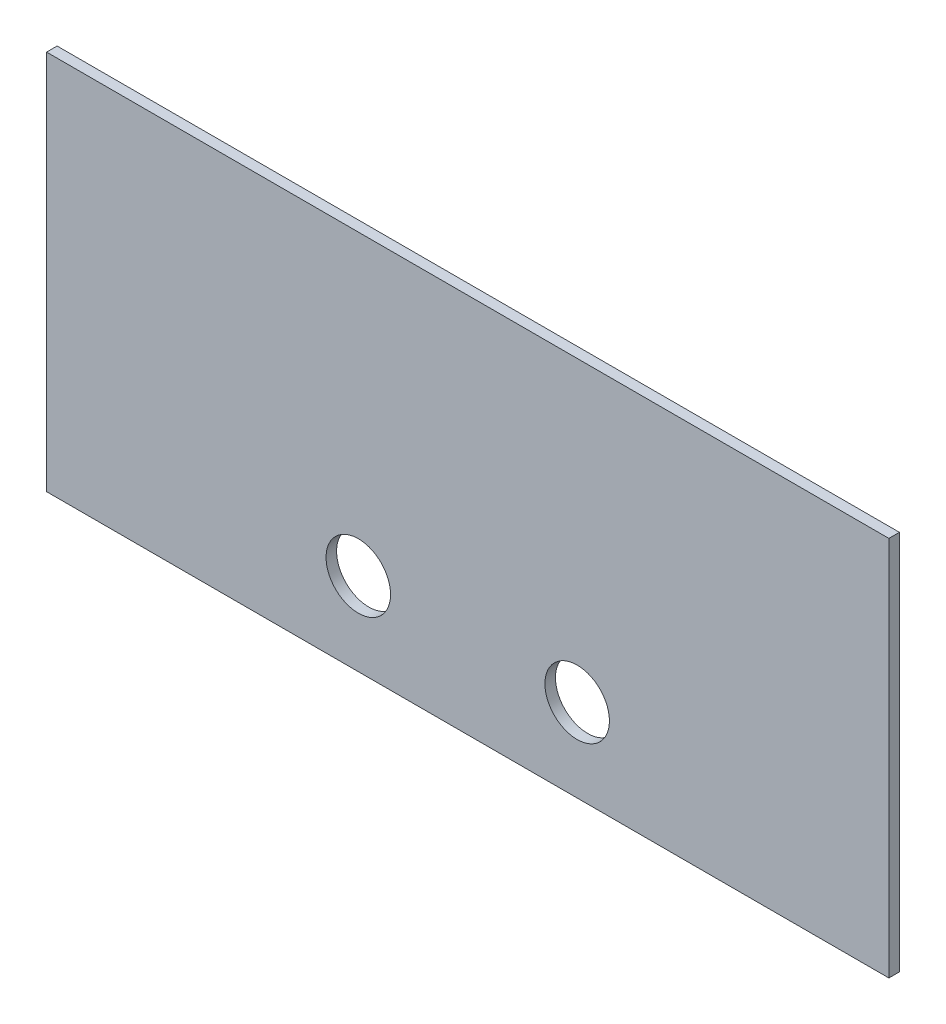
ISO-10303-21;
HEADER;
FILE_DESCRIPTION(('STEP AP214'),'2;1');
FILE_NAME('part.step','',(''),(''),'','','');
FILE_SCHEMA(('AUTOMOTIVE_DESIGN { 1 0 10303 214 1 1 1 1 }'));
ENDSEC;
DATA;
#1=APPLICATION_CONTEXT('core data for automotive mechanical design processes');
#2=APPLICATION_PROTOCOL_DEFINITION('international standard','automotive_design',2000,#1);
#3=PRODUCT_CONTEXT('',#1,'mechanical');
#4=PRODUCT('Part','Part','',(#3));
#5=PRODUCT_RELATED_PRODUCT_CATEGORY('part','',(#4));
#6=PRODUCT_DEFINITION_FORMATION('','',#4);
#7=PRODUCT_DEFINITION_CONTEXT('part definition',#1,'design');
#8=PRODUCT_DEFINITION('design','',#6,#7);
#9=PRODUCT_DEFINITION_SHAPE('','',#8);
#10=(LENGTH_UNIT() NAMED_UNIT(*) SI_UNIT(.MILLI.,.METRE.));
#11=(NAMED_UNIT(*) PLANE_ANGLE_UNIT() SI_UNIT($,.RADIAN.));
#12=(NAMED_UNIT(*) SI_UNIT($,.STERADIAN.) SOLID_ANGLE_UNIT());
#13=UNCERTAINTY_MEASURE_WITH_UNIT(LENGTH_MEASURE(1.E-05),#10,'distance_accuracy_value','');
#14=(GEOMETRIC_REPRESENTATION_CONTEXT(3) GLOBAL_UNCERTAINTY_ASSIGNED_CONTEXT((#13)) GLOBAL_UNIT_ASSIGNED_CONTEXT((#10,
#11,#12)) REPRESENTATION_CONTEXT('',''));
#15=CARTESIAN_POINT('',(0.,0.,0.));
#16=DIRECTION('',(0.,0.,1.));
#17=DIRECTION('',(1.,0.,0.));
#18=AXIS2_PLACEMENT_3D('',#15,#16,#17);
#19=CARTESIAN_POINT('',(0.,0.,1.5875));
#20=DIRECTION('',(0.,0.,-1.));
#21=DIRECTION('',(-1.,0.,0.));
#22=AXIS2_PLACEMENT_3D('',#19,#20,#21);
#23=PLANE('',#22);
#24=DIRECTION('',(0.,-1.,0.));
#25=VECTOR('',#24,1.);
#26=CARTESIAN_POINT('',(0.,0.,1.5875));
#27=LINE('',#26,#25);
#28=CARTESIAN_POINT('',(0.,57.404,1.5875));
#29=VERTEX_POINT('',#28);
#30=CARTESIAN_POINT('',(0.,0.,1.5875));
#31=VERTEX_POINT('',#30);
#32=EDGE_CURVE('E86',#29,#31,#27,.T.);
#33=ORIENTED_EDGE('',*,*,#32,.T.);
#34=DIRECTION('',(1.,0.,0.));
#35=VECTOR('',#34,1.);
#36=CARTESIAN_POINT('',(0.,0.,1.5875));
#37=LINE('',#36,#35);
#38=CARTESIAN_POINT('',(127.,0.,1.5875));
#39=VERTEX_POINT('',#38);
#40=EDGE_CURVE('E81',#31,#39,#37,.T.);
#41=ORIENTED_EDGE('',*,*,#40,.T.);
#42=DIRECTION('',(0.,1.,0.));
#43=VECTOR('',#42,1.);
#44=CARTESIAN_POINT('',(127.,0.,1.5875));
#45=LINE('',#44,#43);
#46=CARTESIAN_POINT('',(127.,57.404,1.5875));
#47=VERTEX_POINT('',#46);
#48=EDGE_CURVE('E84',#39,#47,#45,.T.);
#49=ORIENTED_EDGE('',*,*,#48,.T.);
#50=DIRECTION('',(-1.,0.,0.));
#51=VECTOR('',#50,1.);
#52=CARTESIAN_POINT('',(0.,57.404,1.5875));
#53=LINE('',#52,#51);
#54=EDGE_CURVE('E51',#47,#29,#53,.T.);
#55=ORIENTED_EDGE('',*,*,#54,.T.);
#56=EDGE_LOOP('',(#33,#41,#49,#55));
#57=FACE_BOUND('',#56,.T.);
#58=CARTESIAN_POINT('',(80.0000000000001,12.500102,1.5875));
#59=DIRECTION('',(0.,0.,1.));
#60=DIRECTION('',(1.,0.,0.));
#61=AXIS2_PLACEMENT_3D('',#58,#59,#60);
#62=CIRCLE('',#61,4.86400000000001);
#63=CARTESIAN_POINT('',(84.8640000000001,12.500102,1.5875));
#64=VERTEX_POINT('',#63);
#65=EDGE_CURVE('E101',#64,#64,#62,.T.);
#66=ORIENTED_EDGE('',*,*,#65,.F.);
#67=EDGE_LOOP('',(#66));
#68=FACE_BOUND('',#67,.T.);
#69=CARTESIAN_POINT('',(47.0000000000001,12.500102,1.5875));
#70=DIRECTION('',(0.,0.,1.));
#71=DIRECTION('',(1.,0.,0.));
#72=AXIS2_PLACEMENT_3D('',#69,#70,#71);
#73=CIRCLE('',#72,4.864);
#74=CARTESIAN_POINT('',(51.864,12.500102,1.5875));
#75=VERTEX_POINT('',#74);
#76=EDGE_CURVE('E116',#75,#75,#73,.T.);
#77=ORIENTED_EDGE('',*,*,#76,.F.);
#78=EDGE_LOOP('',(#77));
#79=FACE_BOUND('',#78,.T.);
#80=ADVANCED_FACE('F34',(#57,#68,#79),#23,.F.);
#81=CARTESIAN_POINT('',(0.,0.,0.));
#82=DIRECTION('',(0.,0.,-1.));
#83=DIRECTION('',(-1.,0.,0.));
#84=AXIS2_PLACEMENT_3D('',#81,#82,#83);
#85=PLANE('',#84);
#86=CARTESIAN_POINT('',(80.0000000000001,12.500102,0.));
#87=DIRECTION('',(0.,0.,1.));
#88=DIRECTION('',(1.,0.,0.));
#89=AXIS2_PLACEMENT_3D('',#86,#87,#88);
#90=CIRCLE('',#89,4.86400000000001);
#91=CARTESIAN_POINT('',(84.8640000000001,12.500102,0.));
#92=VERTEX_POINT('',#91);
#93=EDGE_CURVE('E113',#92,#92,#90,.T.);
#94=ORIENTED_EDGE('',*,*,#93,.T.);
#95=EDGE_LOOP('',(#94));
#96=FACE_BOUND('',#95,.T.);
#97=DIRECTION('',(0.,-1.,0.));
#98=VECTOR('',#97,1.);
#99=CARTESIAN_POINT('',(0.,0.,0.));
#100=LINE('',#99,#98);
#101=CARTESIAN_POINT('',(0.,57.404,0.));
#102=VERTEX_POINT('',#101);
#103=CARTESIAN_POINT('',(0.,0.,0.));
#104=VERTEX_POINT('',#103);
#105=EDGE_CURVE('E98',#102,#104,#100,.T.);
#106=ORIENTED_EDGE('',*,*,#105,.F.);
#107=DIRECTION('',(-1.,0.,0.));
#108=VECTOR('',#107,1.);
#109=CARTESIAN_POINT('',(0.,57.404,0.));
#110=LINE('',#109,#108);
#111=CARTESIAN_POINT('',(127.,57.404,0.));
#112=VERTEX_POINT('',#111);
#113=EDGE_CURVE('E74',#112,#102,#110,.T.);
#114=ORIENTED_EDGE('',*,*,#113,.F.);
#115=DIRECTION('',(0.,1.,0.));
#116=VECTOR('',#115,1.);
#117=CARTESIAN_POINT('',(127.,0.,0.));
#118=LINE('',#117,#116);
#119=CARTESIAN_POINT('',(127.,0.,0.));
#120=VERTEX_POINT('',#119);
#121=EDGE_CURVE('E68',#120,#112,#118,.T.);
#122=ORIENTED_EDGE('',*,*,#121,.F.);
#123=DIRECTION('',(1.,0.,0.));
#124=VECTOR('',#123,1.);
#125=CARTESIAN_POINT('',(0.,0.,0.));
#126=LINE('',#125,#124);
#127=EDGE_CURVE('E90',#104,#120,#126,.T.);
#128=ORIENTED_EDGE('',*,*,#127,.F.);
#129=EDGE_LOOP('',(#106,#114,#122,#128));
#130=FACE_BOUND('',#129,.T.);
#131=CARTESIAN_POINT('',(47.0000000000001,12.500102,0.));
#132=DIRECTION('',(0.,0.,1.));
#133=DIRECTION('',(1.,0.,0.));
#134=AXIS2_PLACEMENT_3D('',#131,#132,#133);
#135=CIRCLE('',#134,4.864);
#136=CARTESIAN_POINT('',(51.864,12.500102,0.));
#137=VERTEX_POINT('',#136);
#138=EDGE_CURVE('E119',#137,#137,#135,.T.);
#139=ORIENTED_EDGE('',*,*,#138,.T.);
#140=EDGE_LOOP('',(#139));
#141=FACE_BOUND('',#140,.T.);
#142=ADVANCED_FACE('F109',(#96,#130,#141),#85,.T.);
#143=CARTESIAN_POINT('',(0.,0.,1.5875));
#144=DIRECTION('',(1.,0.,0.));
#145=DIRECTION('',(0.,0.,-1.));
#146=AXIS2_PLACEMENT_3D('',#143,#144,#145);
#147=PLANE('',#146);
#148=ORIENTED_EDGE('',*,*,#105,.T.);
#149=DIRECTION('',(0.,0.,-1.));
#150=VECTOR('',#149,1.);
#151=CARTESIAN_POINT('',(0.,0.,1.5875));
#152=LINE('',#151,#150);
#153=EDGE_CURVE('E11',#31,#104,#152,.T.);
#154=ORIENTED_EDGE('',*,*,#153,.F.);
#155=ORIENTED_EDGE('',*,*,#32,.F.);
#156=DIRECTION('',(0.,0.,-1.));
#157=VECTOR('',#156,1.);
#158=CARTESIAN_POINT('',(0.,57.404,1.5875));
#159=LINE('',#158,#157);
#160=EDGE_CURVE('E94',#29,#102,#159,.T.);
#161=ORIENTED_EDGE('',*,*,#160,.T.);
#162=EDGE_LOOP('',(#148,#154,#155,#161));
#163=FACE_BOUND('',#162,.T.);
#164=ADVANCED_FACE('F36',(#163),#147,.F.);
#165=CARTESIAN_POINT('',(0.,0.,1.5875));
#166=DIRECTION('',(0.,1.,0.));
#167=DIRECTION('',(0.,0.,1.));
#168=AXIS2_PLACEMENT_3D('',#165,#166,#167);
#169=PLANE('',#168);
#170=ORIENTED_EDGE('',*,*,#127,.T.);
#171=DIRECTION('',(0.,0.,-1.));
#172=VECTOR('',#171,1.);
#173=CARTESIAN_POINT('',(127.,0.,1.5875));
#174=LINE('',#173,#172);
#175=EDGE_CURVE('E43',#39,#120,#174,.T.);
#176=ORIENTED_EDGE('',*,*,#175,.F.);
#177=ORIENTED_EDGE('',*,*,#40,.F.);
#178=ORIENTED_EDGE('',*,*,#153,.T.);
#179=EDGE_LOOP('',(#170,#176,#177,#178));
#180=FACE_BOUND('',#179,.T.);
#181=ADVANCED_FACE('F89',(#180),#169,.F.);
#182=CARTESIAN_POINT('',(127.,0.,1.5875));
#183=DIRECTION('',(-1.,0.,0.));
#184=DIRECTION('',(0.,0.,1.));
#185=AXIS2_PLACEMENT_3D('',#182,#183,#184);
#186=PLANE('',#185);
#187=ORIENTED_EDGE('',*,*,#121,.T.);
#188=DIRECTION('',(0.,0.,-1.));
#189=VECTOR('',#188,1.);
#190=CARTESIAN_POINT('',(127.,57.404,1.5875));
#191=LINE('',#190,#189);
#192=EDGE_CURVE('E91',#47,#112,#191,.T.);
#193=ORIENTED_EDGE('',*,*,#192,.F.);
#194=ORIENTED_EDGE('',*,*,#48,.F.);
#195=ORIENTED_EDGE('',*,*,#175,.T.);
#196=EDGE_LOOP('',(#187,#193,#194,#195));
#197=FACE_BOUND('',#196,.T.);
#198=ADVANCED_FACE('F92',(#197),#186,.F.);
#199=CARTESIAN_POINT('',(0.,57.404,1.5875));
#200=DIRECTION('',(0.,-1.,0.));
#201=DIRECTION('',(0.,0.,-1.));
#202=AXIS2_PLACEMENT_3D('',#199,#200,#201);
#203=PLANE('',#202);
#204=ORIENTED_EDGE('',*,*,#113,.T.);
#205=ORIENTED_EDGE('',*,*,#160,.F.);
#206=ORIENTED_EDGE('',*,*,#54,.F.);
#207=ORIENTED_EDGE('',*,*,#192,.T.);
#208=EDGE_LOOP('',(#204,#205,#206,#207));
#209=FACE_BOUND('',#208,.T.);
#210=ADVANCED_FACE('F106',(#209),#203,.F.);
#211=CARTESIAN_POINT('',(80.0000000000001,12.500102,1.5875));
#212=DIRECTION('',(0.,0.,-1.));
#213=DIRECTION('',(-1.,0.,0.));
#214=AXIS2_PLACEMENT_3D('',#211,#212,#213);
#215=CYLINDRICAL_SURFACE('',#214,4.86400000000001);
#216=ORIENTED_EDGE('',*,*,#65,.T.);
#217=EDGE_LOOP('',(#216));
#218=FACE_BOUND('',#217,.T.);
#219=ORIENTED_EDGE('',*,*,#93,.F.);
#220=EDGE_LOOP('',(#219));
#221=FACE_BOUND('',#220,.T.);
#222=ADVANCED_FACE('F136',(#218,#221),#215,.F.);
#223=CARTESIAN_POINT('',(47.0000000000001,12.500102,1.5875));
#224=DIRECTION('',(0.,0.,-1.));
#225=DIRECTION('',(-1.,0.,0.));
#226=AXIS2_PLACEMENT_3D('',#223,#224,#225);
#227=CYLINDRICAL_SURFACE('',#226,4.864);
#228=ORIENTED_EDGE('',*,*,#76,.T.);
#229=EDGE_LOOP('',(#228));
#230=FACE_BOUND('',#229,.T.);
#231=ORIENTED_EDGE('',*,*,#138,.F.);
#232=EDGE_LOOP('',(#231));
#233=FACE_BOUND('',#232,.T.);
#234=ADVANCED_FACE('F125',(#230,#233),#227,.F.);
#235=CLOSED_SHELL('',(#80,#142,#164,#181,#198,#210,#222,#234));
#236=MANIFOLD_SOLID_BREP('B2',#235);
#237=ADVANCED_BREP_SHAPE_REPRESENTATION('',(#18,#236),#14);
#238=SHAPE_DEFINITION_REPRESENTATION(#9,#237);
ENDSEC;
END-ISO-10303-21;
